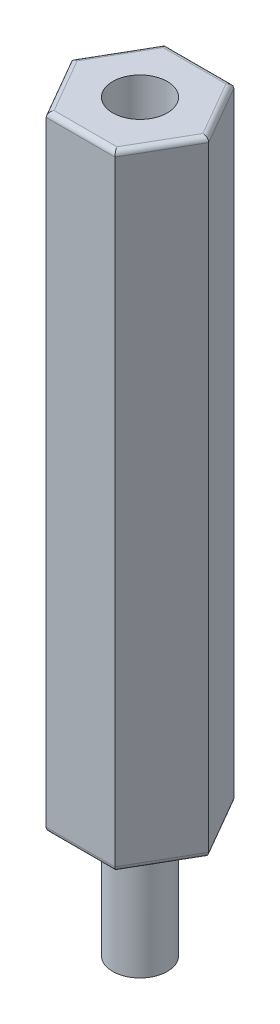
ISO-10303-21;
HEADER;
FILE_DESCRIPTION(('STEP AP214'),'2;1');
FILE_NAME('part.step','',(''),(''),'','','');
FILE_SCHEMA(('AUTOMOTIVE_DESIGN { 1 0 10303 214 1 1 1 1 }'));
ENDSEC;
DATA;
#1=APPLICATION_CONTEXT('core data for automotive mechanical design processes');
#2=APPLICATION_PROTOCOL_DEFINITION('international standard','automotive_design',2000,#1);
#3=PRODUCT_CONTEXT('',#1,'mechanical');
#4=PRODUCT('Part','Part','',(#3));
#5=PRODUCT_RELATED_PRODUCT_CATEGORY('part','',(#4));
#6=PRODUCT_DEFINITION_FORMATION('','',#4);
#7=PRODUCT_DEFINITION_CONTEXT('part definition',#1,'design');
#8=PRODUCT_DEFINITION('design','',#6,#7);
#9=PRODUCT_DEFINITION_SHAPE('','',#8);
#10=(LENGTH_UNIT() NAMED_UNIT(*) SI_UNIT(.MILLI.,.METRE.));
#11=(NAMED_UNIT(*) PLANE_ANGLE_UNIT() SI_UNIT($,.RADIAN.));
#12=(NAMED_UNIT(*) SI_UNIT($,.STERADIAN.) SOLID_ANGLE_UNIT());
#13=UNCERTAINTY_MEASURE_WITH_UNIT(LENGTH_MEASURE(1.E-05),#10,'distance_accuracy_value','');
#14=(GEOMETRIC_REPRESENTATION_CONTEXT(3) GLOBAL_UNCERTAINTY_ASSIGNED_CONTEXT((#13)) GLOBAL_UNIT_ASSIGNED_CONTEXT((#10,
#11,#12)) REPRESENTATION_CONTEXT('',''));
#15=CARTESIAN_POINT('',(0.,0.,0.));
#16=DIRECTION('',(0.,0.,1.));
#17=DIRECTION('',(1.,0.,0.));
#18=AXIS2_PLACEMENT_3D('',#15,#16,#17);
#19=CARTESIAN_POINT('',(2.74818728134262,0.,0.));
#20=DIRECTION('',(0.,1.,0.));
#21=DIRECTION('',(0.,0.,1.));
#22=AXIS2_PLACEMENT_3D('',#19,#20,#21);
#23=PLANE('',#22);
#24=DIRECTION('',(0.5,0.,-0.866025403784439));
#25=VECTOR('',#24,1.);
#26=CARTESIAN_POINT('',(2.57498220058573,0.,-0.1));
#27=LINE('',#26,#25);
#28=CARTESIAN_POINT('',(2.51724717366677,0.,0.));
#29=VERTEX_POINT('',#28);
#30=CARTESIAN_POINT('',(1.25862358683338,0.,2.18));
#31=VERTEX_POINT('',#30);
#32=EDGE_CURVE('E189',#29,#31,#27,.F.);
#33=ORIENTED_EDGE('',*,*,#32,.T.);
#34=DIRECTION('',(1.,0.,0.));
#35=VECTOR('',#34,1.);
#36=CARTESIAN_POINT('',(2.74818728134262,0.,2.18));
#37=LINE('',#36,#35);
#38=CARTESIAN_POINT('',(-1.25862358683338,0.,2.18));
#39=VERTEX_POINT('',#38);
#40=EDGE_CURVE('E42',#31,#39,#37,.F.);
#41=ORIENTED_EDGE('',*,*,#40,.T.);
#42=DIRECTION('',(0.5,0.,0.866025403784439));
#43=VECTOR('',#42,1.);
#44=CARTESIAN_POINT('',(-1.20088855991442,0.,2.28));
#45=LINE('',#44,#43);
#46=CARTESIAN_POINT('',(-2.51724717366677,0.,0.));
#47=VERTEX_POINT('',#46);
#48=EDGE_CURVE('E56',#39,#47,#45,.F.);
#49=ORIENTED_EDGE('',*,*,#48,.T.);
#50=DIRECTION('',(-0.5,0.,0.866025403784439));
#51=VECTOR('',#50,1.);
#52=CARTESIAN_POINT('',(-1.20088855991442,0.,-2.28));
#53=LINE('',#52,#51);
#54=CARTESIAN_POINT('',(-1.25862358683338,0.,-2.18));
#55=VERTEX_POINT('',#54);
#56=EDGE_CURVE('E195',#47,#55,#53,.F.);
#57=ORIENTED_EDGE('',*,*,#56,.T.);
#58=DIRECTION('',(-1.,0.,0.));
#59=VECTOR('',#58,1.);
#60=CARTESIAN_POINT('',(2.74818728134262,0.,-2.18));
#61=LINE('',#60,#59);
#62=CARTESIAN_POINT('',(1.25862358683338,0.,-2.18));
#63=VERTEX_POINT('',#62);
#64=EDGE_CURVE('E193',#55,#63,#61,.F.);
#65=ORIENTED_EDGE('',*,*,#64,.T.);
#66=DIRECTION('',(-0.5,0.,-0.866025403784439));
#67=VECTOR('',#66,1.);
#68=CARTESIAN_POINT('',(2.57498220058573,0.,0.1));
#69=LINE('',#68,#67);
#70=EDGE_CURVE('E191',#63,#29,#69,.F.);
#71=ORIENTED_EDGE('',*,*,#70,.T.);
#72=EDGE_LOOP('',(#33,#41,#49,#57,#65,#71));
#73=FACE_BOUND('',#72,.T.);
#74=CARTESIAN_POINT('',(0.,0.,0.));
#75=DIRECTION('',(0.,1.,0.));
#76=DIRECTION('',(0.,0.,1.));
#77=AXIS2_PLACEMENT_3D('',#74,#75,#76);
#78=CIRCLE('',#77,1.0922);
#79=CARTESIAN_POINT('',(0.,0.,1.0922));
#80=VERTEX_POINT('',#79);
#81=EDGE_CURVE('E11',#80,#80,#78,.F.);
#82=ORIENTED_EDGE('',*,*,#81,.F.);
#83=EDGE_LOOP('',(#82));
#84=FACE_BOUND('',#83,.T.);
#85=ADVANCED_FACE('F34',(#73,#84),#23,.F.);
#86=CARTESIAN_POINT('',(1.37409364067131,25.,2.38));
#87=DIRECTION('',(-0.866025403784439,0.,-0.5));
#88=DIRECTION('',(-0.5,0.,0.866025403784439));
#89=AXIS2_PLACEMENT_3D('',#86,#87,#88);
#90=PLANE('',#89);
#91=DIRECTION('',(0.,-1.,0.));
#92=VECTOR('',#91,1.);
#93=CARTESIAN_POINT('',(2.74818728134262,25.,0.));
#94=LINE('',#93,#92);
#95=CARTESIAN_POINT('',(2.74818728134262,24.8,0.));
#96=VERTEX_POINT('',#95);
#97=CARTESIAN_POINT('',(2.74818728134262,0.199999999999999,0.));
#98=VERTEX_POINT('',#97);
#99=EDGE_CURVE('E150',#96,#98,#94,.T.);
#100=ORIENTED_EDGE('',*,*,#99,.F.);
#101=DIRECTION('',(0.5,0.,-0.866025403784439));
#102=VECTOR('',#101,1.);
#103=CARTESIAN_POINT('',(1.37409364067131,24.8,2.38));
#104=LINE('',#103,#102);
#105=CARTESIAN_POINT('',(1.37409364067131,24.8,2.38));
#106=VERTEX_POINT('',#105);
#107=EDGE_CURVE('E141',#96,#106,#104,.F.);
#108=ORIENTED_EDGE('',*,*,#107,.T.);
#109=DIRECTION('',(0.,-1.,0.));
#110=VECTOR('',#109,1.);
#111=CARTESIAN_POINT('',(1.37409364067131,25.,2.38));
#112=LINE('',#111,#110);
#113=CARTESIAN_POINT('',(1.37409364067131,0.199999999999999,2.38));
#114=VERTEX_POINT('',#113);
#115=EDGE_CURVE('E209',#106,#114,#112,.T.);
#116=ORIENTED_EDGE('',*,*,#115,.T.);
#117=DIRECTION('',(0.5,0.,-0.866025403784439));
#118=VECTOR('',#117,1.);
#119=CARTESIAN_POINT('',(1.37409364067131,0.199999999999999,2.38));
#120=LINE('',#119,#118);
#121=EDGE_CURVE('E182',#114,#98,#120,.T.);
#122=ORIENTED_EDGE('',*,*,#121,.T.);
#123=EDGE_LOOP('',(#100,#108,#116,#122));
#124=FACE_BOUND('',#123,.T.);
#125=ADVANCED_FACE('F254',(#124),#90,.F.);
#126=CARTESIAN_POINT('',(2.74818728134262,25.,0.));
#127=DIRECTION('',(-0.866025403784438,0.,0.5));
#128=DIRECTION('',(0.5,0.,0.866025403784439));
#129=AXIS2_PLACEMENT_3D('',#126,#127,#128);
#130=PLANE('',#129);
#131=DIRECTION('',(0.,-1.,0.));
#132=VECTOR('',#131,1.);
#133=CARTESIAN_POINT('',(1.37409364067131,25.,-2.38));
#134=LINE('',#133,#132);
#135=CARTESIAN_POINT('',(1.37409364067131,24.8,-2.38));
#136=VERTEX_POINT('',#135);
#137=CARTESIAN_POINT('',(1.37409364067131,0.199999999999999,-2.38));
#138=VERTEX_POINT('',#137);
#139=EDGE_CURVE('E153',#136,#138,#134,.T.);
#140=ORIENTED_EDGE('',*,*,#139,.F.);
#141=DIRECTION('',(-0.5,0.,-0.866025403784439));
#142=VECTOR('',#141,1.);
#143=CARTESIAN_POINT('',(2.74818728134262,24.8,0.));
#144=LINE('',#143,#142);
#145=EDGE_CURVE('E187',#136,#96,#144,.F.);
#146=ORIENTED_EDGE('',*,*,#145,.T.);
#147=ORIENTED_EDGE('',*,*,#99,.T.);
#148=DIRECTION('',(-0.5,0.,-0.866025403784439));
#149=VECTOR('',#148,1.);
#150=CARTESIAN_POINT('',(2.74818728134262,0.199999999999999,0.));
#151=LINE('',#150,#149);
#152=EDGE_CURVE('E185',#98,#138,#151,.T.);
#153=ORIENTED_EDGE('',*,*,#152,.T.);
#154=EDGE_LOOP('',(#140,#146,#147,#153));
#155=FACE_BOUND('',#154,.T.);
#156=ADVANCED_FACE('F272',(#155),#130,.F.);
#157=CARTESIAN_POINT('',(1.37409364067131,25.,-2.38));
#158=DIRECTION('',(0.,0.,1.));
#159=DIRECTION('',(1.,0.,0.));
#160=AXIS2_PLACEMENT_3D('',#157,#158,#159);
#161=PLANE('',#160);
#162=DIRECTION('',(0.,-1.,0.));
#163=VECTOR('',#162,1.);
#164=CARTESIAN_POINT('',(-1.37409364067131,25.,-2.38));
#165=LINE('',#164,#163);
#166=CARTESIAN_POINT('',(-1.37409364067131,24.8,-2.38));
#167=VERTEX_POINT('',#166);
#168=CARTESIAN_POINT('',(-1.37409364067131,0.199999999999999,-2.38));
#169=VERTEX_POINT('',#168);
#170=EDGE_CURVE('E263',#167,#169,#165,.T.);
#171=ORIENTED_EDGE('',*,*,#170,.F.);
#172=DIRECTION('',(-1.,0.,0.));
#173=VECTOR('',#172,1.);
#174=CARTESIAN_POINT('',(1.37409364067131,24.8,-2.38));
#175=LINE('',#174,#173);
#176=EDGE_CURVE('E166',#167,#136,#175,.F.);
#177=ORIENTED_EDGE('',*,*,#176,.T.);
#178=ORIENTED_EDGE('',*,*,#139,.T.);
#179=DIRECTION('',(-1.,0.,0.));
#180=VECTOR('',#179,1.);
#181=CARTESIAN_POINT('',(1.37409364067131,0.199999999999999,-2.38));
#182=LINE('',#181,#180);
#183=EDGE_CURVE('E164',#138,#169,#182,.T.);
#184=ORIENTED_EDGE('',*,*,#183,.T.);
#185=EDGE_LOOP('',(#171,#177,#178,#184));
#186=FACE_BOUND('',#185,.T.);
#187=ADVANCED_FACE('F269',(#186),#161,.F.);
#188=CARTESIAN_POINT('',(-1.37409364067131,25.,-2.38));
#189=DIRECTION('',(0.866025403784439,0.,0.5));
#190=DIRECTION('',(0.5,0.,-0.866025403784439));
#191=AXIS2_PLACEMENT_3D('',#188,#189,#190);
#192=PLANE('',#191);
#193=DIRECTION('',(0.,-1.,0.));
#194=VECTOR('',#193,1.);
#195=CARTESIAN_POINT('',(-2.74818728134262,25.,0.));
#196=LINE('',#195,#194);
#197=CARTESIAN_POINT('',(-2.74818728134262,24.8,0.));
#198=VERTEX_POINT('',#197);
#199=CARTESIAN_POINT('',(-2.74818728134262,0.199999999999999,0.));
#200=VERTEX_POINT('',#199);
#201=EDGE_CURVE('E256',#198,#200,#196,.T.);
#202=ORIENTED_EDGE('',*,*,#201,.F.);
#203=DIRECTION('',(-0.5,0.,0.866025403784439));
#204=VECTOR('',#203,1.);
#205=CARTESIAN_POINT('',(-1.37409364067131,24.8,-2.38));
#206=LINE('',#205,#204);
#207=EDGE_CURVE('E171',#198,#167,#206,.F.);
#208=ORIENTED_EDGE('',*,*,#207,.T.);
#209=ORIENTED_EDGE('',*,*,#170,.T.);
#210=DIRECTION('',(-0.5,0.,0.866025403784439));
#211=VECTOR('',#210,1.);
#212=CARTESIAN_POINT('',(-1.37409364067131,0.199999999999999,-2.38));
#213=LINE('',#212,#211);
#214=EDGE_CURVE('E169',#169,#200,#213,.T.);
#215=ORIENTED_EDGE('',*,*,#214,.T.);
#216=EDGE_LOOP('',(#202,#208,#209,#215));
#217=FACE_BOUND('',#216,.T.);
#218=ADVANCED_FACE('F279',(#217),#192,.F.);
#219=CARTESIAN_POINT('',(-2.74818728134262,25.,0.));
#220=DIRECTION('',(0.866025403784439,0.,-0.5));
#221=DIRECTION('',(-0.5,0.,-0.866025403784439));
#222=AXIS2_PLACEMENT_3D('',#219,#220,#221);
#223=PLANE('',#222);
#224=DIRECTION('',(0.,-1.,0.));
#225=VECTOR('',#224,1.);
#226=CARTESIAN_POINT('',(-1.37409364067131,25.,2.38));
#227=LINE('',#226,#225);
#228=CARTESIAN_POINT('',(-1.37409364067131,24.8,2.38));
#229=VERTEX_POINT('',#228);
#230=CARTESIAN_POINT('',(-1.37409364067131,0.199999999999999,2.38));
#231=VERTEX_POINT('',#230);
#232=EDGE_CURVE('E251',#229,#231,#227,.T.);
#233=ORIENTED_EDGE('',*,*,#232,.F.);
#234=DIRECTION('',(0.5,0.,0.866025403784439));
#235=VECTOR('',#234,1.);
#236=CARTESIAN_POINT('',(-2.74818728134262,24.8,0.));
#237=LINE('',#236,#235);
#238=EDGE_CURVE('E175',#229,#198,#237,.F.);
#239=ORIENTED_EDGE('',*,*,#238,.T.);
#240=ORIENTED_EDGE('',*,*,#201,.T.);
#241=DIRECTION('',(0.5,0.,0.866025403784439));
#242=VECTOR('',#241,1.);
#243=CARTESIAN_POINT('',(-2.74818728134262,0.199999999999999,0.));
#244=LINE('',#243,#242);
#245=EDGE_CURVE('E173',#200,#231,#244,.T.);
#246=ORIENTED_EDGE('',*,*,#245,.T.);
#247=EDGE_LOOP('',(#233,#239,#240,#246));
#248=FACE_BOUND('',#247,.T.);
#249=ADVANCED_FACE('F291',(#248),#223,.F.);
#250=CARTESIAN_POINT('',(-1.37409364067131,25.,2.38));
#251=DIRECTION('',(0.,0.,-1.));
#252=DIRECTION('',(-1.,0.,0.));
#253=AXIS2_PLACEMENT_3D('',#250,#251,#252);
#254=PLANE('',#253);
#255=ORIENTED_EDGE('',*,*,#115,.F.);
#256=DIRECTION('',(1.,0.,0.));
#257=VECTOR('',#256,1.);
#258=CARTESIAN_POINT('',(-1.37409364067131,24.8,2.38));
#259=LINE('',#258,#257);
#260=EDGE_CURVE('E180',#106,#229,#259,.F.);
#261=ORIENTED_EDGE('',*,*,#260,.T.);
#262=ORIENTED_EDGE('',*,*,#232,.T.);
#263=DIRECTION('',(1.,0.,0.));
#264=VECTOR('',#263,1.);
#265=CARTESIAN_POINT('',(-1.37409364067131,0.199999999999999,2.38));
#266=LINE('',#265,#264);
#267=EDGE_CURVE('E177',#231,#114,#266,.T.);
#268=ORIENTED_EDGE('',*,*,#267,.T.);
#269=EDGE_LOOP('',(#255,#261,#262,#268));
#270=FACE_BOUND('',#269,.T.);
#271=ADVANCED_FACE('F248',(#270),#254,.F.);
#272=CARTESIAN_POINT('',(2.74818728134262,25.,0.));
#273=DIRECTION('',(0.,1.,0.));
#274=DIRECTION('',(0.,0.,1.));
#275=AXIS2_PLACEMENT_3D('',#272,#273,#274);
#276=PLANE('',#275);
#277=CARTESIAN_POINT('',(0.,25.,0.));
#278=DIRECTION('',(0.,1.,0.));
#279=DIRECTION('',(0.,0.,1.));
#280=AXIS2_PLACEMENT_3D('',#277,#278,#279);
#281=CIRCLE('',#280,1.0922);
#282=CARTESIAN_POINT('',(0.,25.,1.0922));
#283=VERTEX_POINT('',#282);
#284=EDGE_CURVE('E374',#283,#283,#281,.T.);
#285=ORIENTED_EDGE('',*,*,#284,.F.);
#286=EDGE_LOOP('',(#285));
#287=FACE_BOUND('',#286,.T.);
#288=DIRECTION('',(-0.5,0.,-0.866025403784439));
#289=VECTOR('',#288,1.);
#290=CARTESIAN_POINT('',(1.20088855991442,25.,-2.28));
#291=LINE('',#290,#289);
#292=CARTESIAN_POINT('',(2.51724717366677,25.,0.));
#293=VERTEX_POINT('',#292);
#294=CARTESIAN_POINT('',(1.25862358683338,25.,-2.18));
#295=VERTEX_POINT('',#294);
#296=EDGE_CURVE('E129',#293,#295,#291,.T.);
#297=ORIENTED_EDGE('',*,*,#296,.T.);
#298=DIRECTION('',(-1.,0.,0.));
#299=VECTOR('',#298,1.);
#300=CARTESIAN_POINT('',(-1.37409364067131,25.,-2.18));
#301=LINE('',#300,#299);
#302=CARTESIAN_POINT('',(-1.25862358683338,25.,-2.18));
#303=VERTEX_POINT('',#302);
#304=EDGE_CURVE('E162',#295,#303,#301,.T.);
#305=ORIENTED_EDGE('',*,*,#304,.T.);
#306=DIRECTION('',(-0.5,0.,0.866025403784439));
#307=VECTOR('',#306,1.);
#308=CARTESIAN_POINT('',(-2.57498220058573,25.,0.100000000000001));
#309=LINE('',#308,#307);
#310=CARTESIAN_POINT('',(-2.51724717366677,25.,0.));
#311=VERTEX_POINT('',#310);
#312=EDGE_CURVE('E160',#303,#311,#309,.T.);
#313=ORIENTED_EDGE('',*,*,#312,.T.);
#314=DIRECTION('',(0.5,0.,0.866025403784439));
#315=VECTOR('',#314,1.);
#316=CARTESIAN_POINT('',(-1.20088855991442,25.,2.28));
#317=LINE('',#316,#315);
#318=CARTESIAN_POINT('',(-1.25862358683338,25.,2.18));
#319=VERTEX_POINT('',#318);
#320=EDGE_CURVE('E158',#311,#319,#317,.T.);
#321=ORIENTED_EDGE('',*,*,#320,.T.);
#322=DIRECTION('',(1.,0.,0.));
#323=VECTOR('',#322,1.);
#324=CARTESIAN_POINT('',(1.37409364067131,25.,2.18));
#325=LINE('',#324,#323);
#326=CARTESIAN_POINT('',(1.25862358683338,25.,2.18));
#327=VERTEX_POINT('',#326);
#328=EDGE_CURVE('E132',#319,#327,#325,.T.);
#329=ORIENTED_EDGE('',*,*,#328,.T.);
#330=DIRECTION('',(0.5,0.,-0.866025403784439));
#331=VECTOR('',#330,1.);
#332=CARTESIAN_POINT('',(2.57498220058573,25.,-0.1));
#333=LINE('',#332,#331);
#334=EDGE_CURVE('E124',#327,#293,#333,.T.);
#335=ORIENTED_EDGE('',*,*,#334,.T.);
#336=EDGE_LOOP('',(#297,#305,#313,#321,#329,#335));
#337=FACE_BOUND('',#336,.T.);
#338=ADVANCED_FACE('F126',(#287,#337),#276,.T.);
#339=CARTESIAN_POINT('',(2.74818728134262,24.8,2.18));
#340=DIRECTION('',(-1.,0.,0.));
#341=DIRECTION('',(0.,0.,1.));
#342=AXIS2_PLACEMENT_3D('',#339,#340,#341);
#343=CYLINDRICAL_SURFACE('',#342,0.2);
#344=CARTESIAN_POINT('',(-1.25862358683338,24.8,2.18));
#345=DIRECTION('',(-0.866025403784439,0.,-0.5));
#346=DIRECTION('',(-0.5,0.,0.866025403784439));
#347=AXIS2_PLACEMENT_3D('',#344,#345,#346);
#348=ELLIPSE('',#347,0.23094010767585,0.2);
#349=EDGE_CURVE('E144',#229,#319,#348,.T.);
#350=ORIENTED_EDGE('',*,*,#349,.F.);
#351=ORIENTED_EDGE('',*,*,#260,.F.);
#352=CARTESIAN_POINT('',(1.25862358683338,24.8,2.18));
#353=DIRECTION('',(-0.866025403784438,0.,0.5));
#354=DIRECTION('',(0.5,0.,0.866025403784439));
#355=AXIS2_PLACEMENT_3D('',#352,#353,#354);
#356=ELLIPSE('',#355,0.23094010767585,0.2);
#357=EDGE_CURVE('E207',#327,#106,#356,.F.);
#358=ORIENTED_EDGE('',*,*,#357,.F.);
#359=ORIENTED_EDGE('',*,*,#328,.F.);
#360=EDGE_LOOP('',(#350,#351,#358,#359));
#361=FACE_BOUND('',#360,.T.);
#362=ADVANCED_FACE('F314',(#361),#343,.T.);
#363=CARTESIAN_POINT('',(2.57498220058573,24.8,-0.1));
#364=DIRECTION('',(-0.5,0.,0.866025403784439));
#365=DIRECTION('',(0.866025403784439,0.,0.5));
#366=AXIS2_PLACEMENT_3D('',#363,#364,#365);
#367=CYLINDRICAL_SURFACE('',#366,0.2);
#368=ORIENTED_EDGE('',*,*,#357,.T.);
#369=ORIENTED_EDGE('',*,*,#107,.F.);
#370=CARTESIAN_POINT('',(2.51724717366677,24.8,0.));
#371=DIRECTION('',(0.,0.,1.));
#372=DIRECTION('',(1.,0.,0.));
#373=AXIS2_PLACEMENT_3D('',#370,#371,#372);
#374=ELLIPSE('',#373,0.23094010767585,0.2);
#375=EDGE_CURVE('E139',#293,#96,#374,.F.);
#376=ORIENTED_EDGE('',*,*,#375,.F.);
#377=ORIENTED_EDGE('',*,*,#334,.F.);
#378=EDGE_LOOP('',(#368,#369,#376,#377));
#379=FACE_BOUND('',#378,.T.);
#380=ADVANCED_FACE('F140',(#379),#367,.T.);
#381=CARTESIAN_POINT('',(-1.20088855991442,24.8,2.28));
#382=DIRECTION('',(-0.5,0.,-0.866025403784439));
#383=DIRECTION('',(-0.866025403784439,0.,0.5));
#384=AXIS2_PLACEMENT_3D('',#381,#382,#383);
#385=CYLINDRICAL_SURFACE('',#384,0.2);
#386=ORIENTED_EDGE('',*,*,#349,.T.);
#387=ORIENTED_EDGE('',*,*,#320,.F.);
#388=CARTESIAN_POINT('',(-2.51724717366677,24.8,0.));
#389=DIRECTION('',(0.,0.,-1.));
#390=DIRECTION('',(-1.,0.,0.));
#391=AXIS2_PLACEMENT_3D('',#388,#389,#390);
#392=ELLIPSE('',#391,0.23094010767585,0.2);
#393=EDGE_CURVE('E145',#198,#311,#392,.T.);
#394=ORIENTED_EDGE('',*,*,#393,.F.);
#395=ORIENTED_EDGE('',*,*,#238,.F.);
#396=EDGE_LOOP('',(#386,#387,#394,#395));
#397=FACE_BOUND('',#396,.T.);
#398=ADVANCED_FACE('F305',(#397),#385,.T.);
#399=CARTESIAN_POINT('',(2.57498220058573,24.8,0.1));
#400=DIRECTION('',(0.5,0.,0.866025403784439));
#401=DIRECTION('',(0.866025403784438,0.,-0.5));
#402=AXIS2_PLACEMENT_3D('',#399,#400,#401);
#403=CYLINDRICAL_SURFACE('',#402,0.2);
#404=ORIENTED_EDGE('',*,*,#375,.T.);
#405=ORIENTED_EDGE('',*,*,#145,.F.);
#406=CARTESIAN_POINT('',(1.25862358683338,24.8,-2.18));
#407=DIRECTION('',(0.866025403784439,0.,0.5));
#408=DIRECTION('',(-0.5,0.,0.866025403784439));
#409=AXIS2_PLACEMENT_3D('',#406,#407,#408);
#410=ELLIPSE('',#409,0.23094010767585,0.2);
#411=EDGE_CURVE('E148',#295,#136,#410,.F.);
#412=ORIENTED_EDGE('',*,*,#411,.F.);
#413=ORIENTED_EDGE('',*,*,#296,.F.);
#414=EDGE_LOOP('',(#404,#405,#412,#413));
#415=FACE_BOUND('',#414,.T.);
#416=ADVANCED_FACE('F147',(#415),#403,.T.);
#417=CARTESIAN_POINT('',(-1.20088855991442,24.8,-2.28));
#418=DIRECTION('',(0.5,0.,-0.866025403784439));
#419=DIRECTION('',(-0.866025403784439,0.,-0.5));
#420=AXIS2_PLACEMENT_3D('',#417,#418,#419);
#421=CYLINDRICAL_SURFACE('',#420,0.2);
#422=ORIENTED_EDGE('',*,*,#393,.T.);
#423=ORIENTED_EDGE('',*,*,#312,.F.);
#424=CARTESIAN_POINT('',(-1.25862358683338,24.8,-2.18));
#425=DIRECTION('',(0.866025403784439,0.,-0.5));
#426=DIRECTION('',(-0.5,0.,-0.866025403784439));
#427=AXIS2_PLACEMENT_3D('',#424,#425,#426);
#428=ELLIPSE('',#427,0.23094010767585,0.2);
#429=EDGE_CURVE('E199',#167,#303,#428,.T.);
#430=ORIENTED_EDGE('',*,*,#429,.F.);
#431=ORIENTED_EDGE('',*,*,#207,.F.);
#432=EDGE_LOOP('',(#422,#423,#430,#431));
#433=FACE_BOUND('',#432,.T.);
#434=ADVANCED_FACE('F309',(#433),#421,.T.);
#435=CARTESIAN_POINT('',(2.74818728134262,24.8,-2.18));
#436=DIRECTION('',(1.,0.,0.));
#437=DIRECTION('',(0.,0.,-1.));
#438=AXIS2_PLACEMENT_3D('',#435,#436,#437);
#439=CYLINDRICAL_SURFACE('',#438,0.2);
#440=ORIENTED_EDGE('',*,*,#411,.T.);
#441=ORIENTED_EDGE('',*,*,#176,.F.);
#442=ORIENTED_EDGE('',*,*,#429,.T.);
#443=ORIENTED_EDGE('',*,*,#304,.F.);
#444=EDGE_LOOP('',(#440,#441,#442,#443));
#445=FACE_BOUND('',#444,.T.);
#446=ADVANCED_FACE('F311',(#445),#439,.T.);
#447=CARTESIAN_POINT('',(1.37409364067131,0.199999999999999,-2.18));
#448=DIRECTION('',(-1.,0.,0.));
#449=DIRECTION('',(0.,0.,1.));
#450=AXIS2_PLACEMENT_3D('',#447,#448,#449);
#451=CYLINDRICAL_SURFACE('',#450,0.2);
#452=CARTESIAN_POINT('',(1.25862358683338,0.199999999999999,-2.18));
#453=DIRECTION('',(-0.866025403784439,0.,-0.5));
#454=DIRECTION('',(0.5,0.,-0.866025403784439));
#455=AXIS2_PLACEMENT_3D('',#452,#453,#454);
#456=ELLIPSE('',#455,0.23094010767585,0.2);
#457=EDGE_CURVE('E220',#63,#138,#456,.F.);
#458=ORIENTED_EDGE('',*,*,#457,.F.);
#459=ORIENTED_EDGE('',*,*,#64,.F.);
#460=CARTESIAN_POINT('',(-1.25862358683338,0.199999999999999,-2.18));
#461=DIRECTION('',(-0.866025403784439,0.,0.5));
#462=DIRECTION('',(-0.5,0.,-0.866025403784439));
#463=AXIS2_PLACEMENT_3D('',#460,#461,#462);
#464=ELLIPSE('',#463,0.23094010767585,0.2);
#465=EDGE_CURVE('E201',#169,#55,#464,.T.);
#466=ORIENTED_EDGE('',*,*,#465,.F.);
#467=ORIENTED_EDGE('',*,*,#183,.F.);
#468=EDGE_LOOP('',(#458,#459,#466,#467));
#469=FACE_BOUND('',#468,.T.);
#470=ADVANCED_FACE('F36',(#469),#451,.T.);
#471=CARTESIAN_POINT('',(-1.20088855991442,0.199999999999999,-2.28));
#472=DIRECTION('',(-0.5,0.,0.866025403784439));
#473=DIRECTION('',(0.866025403784439,0.,0.5));
#474=AXIS2_PLACEMENT_3D('',#471,#472,#473);
#475=CYLINDRICAL_SURFACE('',#474,0.2);
#476=ORIENTED_EDGE('',*,*,#465,.T.);
#477=ORIENTED_EDGE('',*,*,#56,.F.);
#478=CARTESIAN_POINT('',(-2.51724717366677,0.199999999999999,0.));
#479=DIRECTION('',(0.,0.,1.));
#480=DIRECTION('',(-1.,0.,0.));
#481=AXIS2_PLACEMENT_3D('',#478,#479,#480);
#482=ELLIPSE('',#481,0.23094010767585,0.2);
#483=EDGE_CURVE('E217',#200,#47,#482,.T.);
#484=ORIENTED_EDGE('',*,*,#483,.F.);
#485=ORIENTED_EDGE('',*,*,#214,.F.);
#486=EDGE_LOOP('',(#476,#477,#484,#485));
#487=FACE_BOUND('',#486,.T.);
#488=ADVANCED_FACE('F226',(#487),#475,.T.);
#489=CARTESIAN_POINT('',(2.57498220058573,0.199999999999999,0.1));
#490=DIRECTION('',(-0.5,0.,-0.866025403784439));
#491=DIRECTION('',(-0.866025403784438,0.,0.5));
#492=AXIS2_PLACEMENT_3D('',#489,#490,#491);
#493=CYLINDRICAL_SURFACE('',#492,0.2);
#494=ORIENTED_EDGE('',*,*,#457,.T.);
#495=ORIENTED_EDGE('',*,*,#152,.F.);
#496=CARTESIAN_POINT('',(2.51724717366677,0.199999999999999,0.));
#497=DIRECTION('',(0.,0.,-1.));
#498=DIRECTION('',(1.,0.,0.));
#499=AXIS2_PLACEMENT_3D('',#496,#497,#498);
#500=ELLIPSE('',#499,0.23094010767585,0.2);
#501=EDGE_CURVE('E214',#29,#98,#500,.F.);
#502=ORIENTED_EDGE('',*,*,#501,.F.);
#503=ORIENTED_EDGE('',*,*,#70,.F.);
#504=EDGE_LOOP('',(#494,#495,#502,#503));
#505=FACE_BOUND('',#504,.T.);
#506=ADVANCED_FACE('F238',(#505),#493,.T.);
#507=CARTESIAN_POINT('',(-2.57498220058573,0.199999999999999,-0.0999999999999992));
#508=DIRECTION('',(0.5,0.,0.866025403784439));
#509=DIRECTION('',(0.866025403784439,0.,-0.5));
#510=AXIS2_PLACEMENT_3D('',#507,#508,#509);
#511=CYLINDRICAL_SURFACE('',#510,0.2);
#512=ORIENTED_EDGE('',*,*,#483,.T.);
#513=ORIENTED_EDGE('',*,*,#48,.F.);
#514=CARTESIAN_POINT('',(-1.25862358683338,0.199999999999999,2.18));
#515=DIRECTION('',(0.866025403784439,0.,0.5));
#516=DIRECTION('',(-0.5,0.,0.866025403784439));
#517=AXIS2_PLACEMENT_3D('',#514,#515,#516);
#518=ELLIPSE('',#517,0.23094010767585,0.2);
#519=EDGE_CURVE('E49',#231,#39,#518,.T.);
#520=ORIENTED_EDGE('',*,*,#519,.F.);
#521=ORIENTED_EDGE('',*,*,#245,.F.);
#522=EDGE_LOOP('',(#512,#513,#520,#521));
#523=FACE_BOUND('',#522,.T.);
#524=ADVANCED_FACE('F317',(#523),#511,.T.);
#525=CARTESIAN_POINT('',(1.20088855991442,0.199999999999999,2.28));
#526=DIRECTION('',(0.5,0.,-0.866025403784439));
#527=DIRECTION('',(-0.866025403784439,0.,-0.5));
#528=AXIS2_PLACEMENT_3D('',#525,#526,#527);
#529=CYLINDRICAL_SURFACE('',#528,0.2);
#530=ORIENTED_EDGE('',*,*,#501,.T.);
#531=ORIENTED_EDGE('',*,*,#121,.F.);
#532=CARTESIAN_POINT('',(1.25862358683338,0.199999999999999,2.18));
#533=DIRECTION('',(0.866025403784438,0.,-0.5));
#534=DIRECTION('',(-0.5,0.,-0.866025403784439));
#535=AXIS2_PLACEMENT_3D('',#532,#533,#534);
#536=ELLIPSE('',#535,0.23094010767585,0.2);
#537=EDGE_CURVE('E210',#31,#114,#536,.F.);
#538=ORIENTED_EDGE('',*,*,#537,.F.);
#539=ORIENTED_EDGE('',*,*,#32,.F.);
#540=EDGE_LOOP('',(#530,#531,#538,#539));
#541=FACE_BOUND('',#540,.T.);
#542=ADVANCED_FACE('F242',(#541),#529,.T.);
#543=CARTESIAN_POINT('',(-1.37409364067131,0.199999999999999,2.18));
#544=DIRECTION('',(1.,0.,0.));
#545=DIRECTION('',(0.,0.,-1.));
#546=AXIS2_PLACEMENT_3D('',#543,#544,#545);
#547=CYLINDRICAL_SURFACE('',#546,0.2);
#548=ORIENTED_EDGE('',*,*,#519,.T.);
#549=ORIENTED_EDGE('',*,*,#40,.F.);
#550=ORIENTED_EDGE('',*,*,#537,.T.);
#551=ORIENTED_EDGE('',*,*,#267,.F.);
#552=EDGE_LOOP('',(#548,#549,#550,#551));
#553=FACE_BOUND('',#552,.T.);
#554=ADVANCED_FACE('F243',(#553),#547,.T.);
#555=CARTESIAN_POINT('',(0.,-4.76,0.));
#556=DIRECTION('',(0.,1.,0.));
#557=DIRECTION('',(0.,0.,1.));
#558=AXIS2_PLACEMENT_3D('',#555,#556,#557);
#559=CYLINDRICAL_SURFACE('',#558,1.0922);
#560=CARTESIAN_POINT('',(0.,-4.76,0.));
#561=DIRECTION('',(0.,-1.,0.));
#562=DIRECTION('',(0.,0.,-1.));
#563=AXIS2_PLACEMENT_3D('',#560,#561,#562);
#564=CIRCLE('',#563,1.0922);
#565=CARTESIAN_POINT('',(0.,-4.76,-1.0922));
#566=VERTEX_POINT('',#565);
#567=EDGE_CURVE('E212',#566,#566,#564,.T.);
#568=ORIENTED_EDGE('',*,*,#567,.F.);
#569=EDGE_LOOP('',(#568));
#570=FACE_BOUND('',#569,.T.);
#571=ORIENTED_EDGE('',*,*,#81,.T.);
#572=EDGE_LOOP('',(#571));
#573=FACE_BOUND('',#572,.T.);
#574=ADVANCED_FACE('F348',(#570,#573),#559,.T.);
#575=CARTESIAN_POINT('',(0.,-4.76,0.));
#576=DIRECTION('',(0.,-1.,0.));
#577=DIRECTION('',(0.,0.,-1.));
#578=AXIS2_PLACEMENT_3D('',#575,#576,#577);
#579=PLANE('',#578);
#580=ORIENTED_EDGE('',*,*,#567,.T.);
#581=EDGE_LOOP('',(#580));
#582=FACE_BOUND('',#581,.T.);
#583=ADVANCED_FACE('F352',(#582),#579,.T.);
#584=CARTESIAN_POINT('',(0.,20.24,0.));
#585=DIRECTION('',(0.,1.,0.));
#586=DIRECTION('',(0.,0.,1.));
#587=AXIS2_PLACEMENT_3D('',#584,#585,#586);
#588=CYLINDRICAL_SURFACE('',#587,1.0922);
#589=CARTESIAN_POINT('',(0.,20.24,0.));
#590=DIRECTION('',(0.,1.,0.));
#591=DIRECTION('',(0.,0.,1.));
#592=AXIS2_PLACEMENT_3D('',#589,#590,#591);
#593=CIRCLE('',#592,1.0922);
#594=CARTESIAN_POINT('',(0.,20.24,1.0922));
#595=VERTEX_POINT('',#594);
#596=EDGE_CURVE('E373',#595,#595,#593,.T.);
#597=ORIENTED_EDGE('',*,*,#596,.F.);
#598=EDGE_LOOP('',(#597));
#599=FACE_BOUND('',#598,.T.);
#600=ORIENTED_EDGE('',*,*,#284,.T.);
#601=EDGE_LOOP('',(#600));
#602=FACE_BOUND('',#601,.T.);
#603=ADVANCED_FACE('F357',(#599,#602),#588,.F.);
#604=CARTESIAN_POINT('',(0.,20.24,0.));
#605=DIRECTION('',(0.,1.,0.));
#606=DIRECTION('',(0.,0.,1.));
#607=AXIS2_PLACEMENT_3D('',#604,#605,#606);
#608=PLANE('',#607);
#609=ORIENTED_EDGE('',*,*,#596,.T.);
#610=EDGE_LOOP('',(#609));
#611=FACE_BOUND('',#610,.T.);
#612=ADVANCED_FACE('F365',(#611),#608,.T.);
#613=CLOSED_SHELL('',(#85,#125,#156,#187,#218,#249,#271,#338,#362,#380,#398,#416,#434,#446,#470,
#488,#506,#524,#542,#554,#574,#583,#603,#612));
#614=MANIFOLD_SOLID_BREP('B2',#613);
#615=ADVANCED_BREP_SHAPE_REPRESENTATION('',(#18,#614),#14);
#616=SHAPE_DEFINITION_REPRESENTATION(#9,#615);
ENDSEC;
END-ISO-10303-21;
